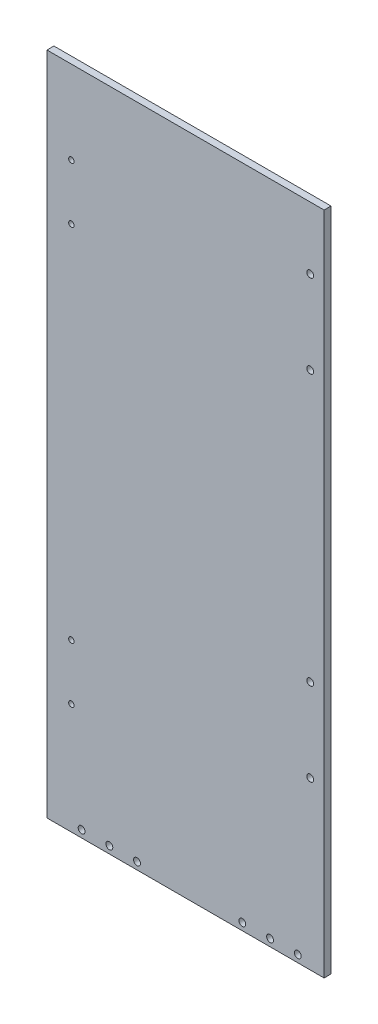
ISO-10303-21;
HEADER;
FILE_DESCRIPTION(('STEP AP214'),'2;1');
FILE_NAME('part.step','',(''),(''),'','','');
FILE_SCHEMA(('AUTOMOTIVE_DESIGN { 1 0 10303 214 1 1 1 1 }'));
ENDSEC;
DATA;
#1=APPLICATION_CONTEXT('core data for automotive mechanical design processes');
#2=APPLICATION_PROTOCOL_DEFINITION('international standard','automotive_design',2000,#1);
#3=PRODUCT_CONTEXT('',#1,'mechanical');
#4=PRODUCT('Part','Part','',(#3));
#5=PRODUCT_RELATED_PRODUCT_CATEGORY('part','',(#4));
#6=PRODUCT_DEFINITION_FORMATION('','',#4);
#7=PRODUCT_DEFINITION_CONTEXT('part definition',#1,'design');
#8=PRODUCT_DEFINITION('design','',#6,#7);
#9=PRODUCT_DEFINITION_SHAPE('','',#8);
#10=(LENGTH_UNIT() NAMED_UNIT(*) SI_UNIT(.MILLI.,.METRE.));
#11=(NAMED_UNIT(*) PLANE_ANGLE_UNIT() SI_UNIT($,.RADIAN.));
#12=(NAMED_UNIT(*) SI_UNIT($,.STERADIAN.) SOLID_ANGLE_UNIT());
#13=UNCERTAINTY_MEASURE_WITH_UNIT(LENGTH_MEASURE(1.E-05),#10,'distance_accuracy_value','');
#14=(GEOMETRIC_REPRESENTATION_CONTEXT(3) GLOBAL_UNCERTAINTY_ASSIGNED_CONTEXT((#13)) GLOBAL_UNIT_ASSIGNED_CONTEXT((#10,
#11,#12)) REPRESENTATION_CONTEXT('',''));
#15=CARTESIAN_POINT('',(0.,0.,0.));
#16=DIRECTION('',(0.,0.,1.));
#17=DIRECTION('',(1.,0.,0.));
#18=AXIS2_PLACEMENT_3D('',#15,#16,#17);
#19=CARTESIAN_POINT('',(0.,-234.461538461538,6.35));
#20=DIRECTION('',(0.,-1.,0.));
#21=DIRECTION('',(1.,0.,0.));
#22=AXIS2_PLACEMENT_3D('',#19,#20,#21);
#23=PLANE('',#22);
#24=DIRECTION('',(-1.,0.,0.));
#25=VECTOR('',#24,1.);
#26=CARTESIAN_POINT('',(0.,-234.461538461538,0.));
#27=LINE('',#26,#25);
#28=CARTESIAN_POINT('',(0.,-234.461538461538,0.));
#29=VERTEX_POINT('',#28);
#30=CARTESIAN_POINT('',(-254.,-234.461538461538,0.));
#31=VERTEX_POINT('',#30);
#32=EDGE_CURVE('E109',#29,#31,#27,.T.);
#33=ORIENTED_EDGE('',*,*,#32,.T.);
#34=DIRECTION('',(0.,0.,-1.));
#35=VECTOR('',#34,1.);
#36=CARTESIAN_POINT('',(-254.,-234.461538461538,6.35));
#37=LINE('',#36,#35);
#38=CARTESIAN_POINT('',(-254.,-234.461538461538,6.35));
#39=VERTEX_POINT('',#38);
#40=EDGE_CURVE('E11',#39,#31,#37,.T.);
#41=ORIENTED_EDGE('',*,*,#40,.F.);
#42=DIRECTION('',(-1.,0.,0.));
#43=VECTOR('',#42,1.);
#44=CARTESIAN_POINT('',(0.,-234.461538461538,6.35));
#45=LINE('',#44,#43);
#46=CARTESIAN_POINT('',(0.,-234.461538461538,6.35));
#47=VERTEX_POINT('',#46);
#48=EDGE_CURVE('E91',#47,#39,#45,.T.);
#49=ORIENTED_EDGE('',*,*,#48,.F.);
#50=DIRECTION('',(0.,0.,-1.));
#51=VECTOR('',#50,1.);
#52=CARTESIAN_POINT('',(0.,-234.461538461538,6.35));
#53=LINE('',#52,#51);
#54=EDGE_CURVE('E58',#47,#29,#53,.T.);
#55=ORIENTED_EDGE('',*,*,#54,.T.);
#56=EDGE_LOOP('',(#33,#41,#49,#55));
#57=FACE_BOUND('',#56,.T.);
#58=ADVANCED_FACE('F41',(#57),#23,.F.);
#59=CARTESIAN_POINT('',(-254.,-234.461538461538,6.35));
#60=DIRECTION('',(1.,0.,0.));
#61=DIRECTION('',(0.,1.,0.));
#62=AXIS2_PLACEMENT_3D('',#59,#60,#61);
#63=PLANE('',#62);
#64=DIRECTION('',(0.,-1.,0.));
#65=VECTOR('',#64,1.);
#66=CARTESIAN_POINT('',(-254.,-234.461538461538,0.));
#67=LINE('',#66,#65);
#68=CARTESIAN_POINT('',(-254.,-844.061538461538,0.));
#69=VERTEX_POINT('',#68);
#70=EDGE_CURVE('E97',#31,#69,#67,.T.);
#71=ORIENTED_EDGE('',*,*,#70,.T.);
#72=DIRECTION('',(0.,0.,-1.));
#73=VECTOR('',#72,1.);
#74=CARTESIAN_POINT('',(-254.,-844.061538461538,6.35));
#75=LINE('',#74,#73);
#76=CARTESIAN_POINT('',(-254.,-844.061538461538,6.35));
#77=VERTEX_POINT('',#76);
#78=EDGE_CURVE('E50',#77,#69,#75,.T.);
#79=ORIENTED_EDGE('',*,*,#78,.F.);
#80=DIRECTION('',(0.,-1.,0.));
#81=VECTOR('',#80,1.);
#82=CARTESIAN_POINT('',(-254.,-234.461538461538,6.35));
#83=LINE('',#82,#81);
#84=EDGE_CURVE('E83',#39,#77,#83,.T.);
#85=ORIENTED_EDGE('',*,*,#84,.F.);
#86=ORIENTED_EDGE('',*,*,#40,.T.);
#87=EDGE_LOOP('',(#71,#79,#85,#86));
#88=FACE_BOUND('',#87,.T.);
#89=ADVANCED_FACE('F96',(#88),#63,.F.);
#90=CARTESIAN_POINT('',(0.,-844.061538461538,6.35));
#91=DIRECTION('',(0.,-1.,0.));
#92=DIRECTION('',(0.,0.,-1.));
#93=AXIS2_PLACEMENT_3D('',#90,#91,#92);
#94=PLANE('',#93);
#95=DIRECTION('',(-1.,0.,0.));
#96=VECTOR('',#95,1.);
#97=CARTESIAN_POINT('',(0.,-844.061538461538,0.));
#98=LINE('',#97,#96);
#99=CARTESIAN_POINT('',(0.,-844.061538461538,0.));
#100=VERTEX_POINT('',#99);
#101=EDGE_CURVE('E115',#100,#69,#98,.T.);
#102=ORIENTED_EDGE('',*,*,#101,.F.);
#103=DIRECTION('',(0.,0.,-1.));
#104=VECTOR('',#103,1.);
#105=CARTESIAN_POINT('',(0.,-844.061538461538,6.35));
#106=LINE('',#105,#104);
#107=CARTESIAN_POINT('',(0.,-844.061538461538,6.35));
#108=VERTEX_POINT('',#107);
#109=EDGE_CURVE('E72',#108,#100,#106,.T.);
#110=ORIENTED_EDGE('',*,*,#109,.F.);
#111=DIRECTION('',(-1.,0.,0.));
#112=VECTOR('',#111,1.);
#113=CARTESIAN_POINT('',(0.,-844.061538461538,6.35));
#114=LINE('',#113,#112);
#115=EDGE_CURVE('E90',#108,#77,#114,.T.);
#116=ORIENTED_EDGE('',*,*,#115,.T.);
#117=ORIENTED_EDGE('',*,*,#78,.T.);
#118=EDGE_LOOP('',(#102,#110,#116,#117));
#119=FACE_BOUND('',#118,.T.);
#120=ADVANCED_FACE('F101',(#119),#94,.T.);
#121=CARTESIAN_POINT('',(0.,-234.461538461538,6.35));
#122=DIRECTION('',(1.,0.,0.));
#123=DIRECTION('',(0.,1.,0.));
#124=AXIS2_PLACEMENT_3D('',#121,#122,#123);
#125=PLANE('',#124);
#126=DIRECTION('',(0.,-1.,0.));
#127=VECTOR('',#126,1.);
#128=CARTESIAN_POINT('',(0.,-234.461538461538,0.));
#129=LINE('',#128,#127);
#130=EDGE_CURVE('E118',#29,#100,#129,.T.);
#131=ORIENTED_EDGE('',*,*,#130,.F.);
#132=ORIENTED_EDGE('',*,*,#54,.F.);
#133=DIRECTION('',(0.,-1.,0.));
#134=VECTOR('',#133,1.);
#135=CARTESIAN_POINT('',(0.,-234.461538461538,6.35));
#136=LINE('',#135,#134);
#137=EDGE_CURVE('E103',#47,#108,#136,.T.);
#138=ORIENTED_EDGE('',*,*,#137,.T.);
#139=ORIENTED_EDGE('',*,*,#109,.T.);
#140=EDGE_LOOP('',(#131,#132,#138,#139));
#141=FACE_BOUND('',#140,.T.);
#142=ADVANCED_FACE('F252',(#141),#125,.T.);
#143=CARTESIAN_POINT('',(0.,0.,6.35));
#144=DIRECTION('',(0.,0.,1.));
#145=DIRECTION('',(1.,0.,0.));
#146=AXIS2_PLACEMENT_3D('',#143,#144,#145);
#147=PLANE('',#146);
#148=CARTESIAN_POINT('',(-12.7,-291.611538461538,6.35));
#149=DIRECTION('',(0.,0.,1.));
#150=DIRECTION('',(1.,0.,0.));
#151=AXIS2_PLACEMENT_3D('',#148,#149,#150);
#152=CIRCLE('',#151,3.175);
#153=CARTESIAN_POINT('',(-9.52499999999997,-291.611538461538,6.35));
#154=VERTEX_POINT('',#153);
#155=EDGE_CURVE('E225',#154,#154,#152,.T.);
#156=ORIENTED_EDGE('',*,*,#155,.F.);
#157=EDGE_LOOP('',(#156));
#158=FACE_BOUND('',#157,.T.);
#159=CARTESIAN_POINT('',(-12.7,-615.461538461538,6.35));
#160=DIRECTION('',(0.,0.,1.));
#161=DIRECTION('',(1.,0.,0.));
#162=AXIS2_PLACEMENT_3D('',#159,#160,#161);
#163=CIRCLE('',#162,3.175);
#164=CARTESIAN_POINT('',(-9.52499999999996,-615.461538461538,6.35));
#165=VERTEX_POINT('',#164);
#166=EDGE_CURVE('E226',#165,#165,#163,.T.);
#167=ORIENTED_EDGE('',*,*,#166,.F.);
#168=EDGE_LOOP('',(#167));
#169=FACE_BOUND('',#168,.T.);
#170=CARTESIAN_POINT('',(-12.7,-691.661538461538,6.35));
#171=DIRECTION('',(0.,0.,1.));
#172=DIRECTION('',(1.,0.,0.));
#173=AXIS2_PLACEMENT_3D('',#170,#171,#172);
#174=CIRCLE('',#173,3.175);
#175=CARTESIAN_POINT('',(-9.52499999999997,-691.661538461538,6.35));
#176=VERTEX_POINT('',#175);
#177=EDGE_CURVE('E208',#176,#176,#174,.T.);
#178=ORIENTED_EDGE('',*,*,#177,.F.);
#179=EDGE_LOOP('',(#178));
#180=FACE_BOUND('',#179,.T.);
#181=CARTESIAN_POINT('',(-12.7,-367.811538461538,6.35));
#182=DIRECTION('',(0.,0.,1.));
#183=DIRECTION('',(1.,0.,0.));
#184=AXIS2_PLACEMENT_3D('',#181,#182,#183);
#185=CIRCLE('',#184,3.175);
#186=CARTESIAN_POINT('',(-9.52499999999997,-367.811538461538,6.35));
#187=VERTEX_POINT('',#186);
#188=EDGE_CURVE('E217',#187,#187,#185,.T.);
#189=ORIENTED_EDGE('',*,*,#188,.F.);
#190=EDGE_LOOP('',(#189));
#191=FACE_BOUND('',#190,.T.);
#192=CARTESIAN_POINT('',(-24.13,-837.457538461538,6.35));
#193=DIRECTION('',(0.,0.,-1.));
#194=DIRECTION('',(-1.,0.,0.));
#195=AXIS2_PLACEMENT_3D('',#192,#193,#194);
#196=CIRCLE('',#195,3.175);
#197=CARTESIAN_POINT('',(-27.305,-837.457538461538,6.35));
#198=VERTEX_POINT('',#197);
#199=EDGE_CURVE('E133',#198,#198,#196,.T.);
#200=ORIENTED_EDGE('',*,*,#199,.T.);
#201=EDGE_LOOP('',(#200));
#202=FACE_BOUND('',#201,.T.);
#203=CARTESIAN_POINT('',(-49.53,-837.457538461538,6.35));
#204=DIRECTION('',(0.,0.,-1.));
#205=DIRECTION('',(-1.,0.,0.));
#206=AXIS2_PLACEMENT_3D('',#203,#204,#205);
#207=CIRCLE('',#206,3.175);
#208=CARTESIAN_POINT('',(-52.705,-837.457538461538,6.35));
#209=VERTEX_POINT('',#208);
#210=EDGE_CURVE('E197',#209,#209,#207,.T.);
#211=ORIENTED_EDGE('',*,*,#210,.T.);
#212=EDGE_LOOP('',(#211));
#213=FACE_BOUND('',#212,.T.);
#214=CARTESIAN_POINT('',(-74.9915552075629,-837.457538461538,6.35));
#215=DIRECTION('',(0.,0.,-1.));
#216=DIRECTION('',(-1.,0.,0.));
#217=AXIS2_PLACEMENT_3D('',#214,#215,#216);
#218=CIRCLE('',#217,3.175);
#219=CARTESIAN_POINT('',(-78.1665552075629,-837.457538461538,6.35));
#220=VERTEX_POINT('',#219);
#221=EDGE_CURVE('E189',#220,#220,#218,.T.);
#222=ORIENTED_EDGE('',*,*,#221,.T.);
#223=EDGE_LOOP('',(#222));
#224=FACE_BOUND('',#223,.T.);
#225=CARTESIAN_POINT('',(-196.85,-837.457538461538,6.35));
#226=DIRECTION('',(0.,0.,-1.));
#227=DIRECTION('',(-1.,0.,0.));
#228=AXIS2_PLACEMENT_3D('',#225,#226,#227);
#229=CIRCLE('',#228,3.175);
#230=CARTESIAN_POINT('',(-200.025,-837.457538461538,6.35));
#231=VERTEX_POINT('',#230);
#232=EDGE_CURVE('E181',#231,#231,#229,.T.);
#233=ORIENTED_EDGE('',*,*,#232,.T.);
#234=EDGE_LOOP('',(#233));
#235=FACE_BOUND('',#234,.T.);
#236=CARTESIAN_POINT('',(-171.45,-837.457538461538,6.35));
#237=DIRECTION('',(0.,0.,-1.));
#238=DIRECTION('',(-1.,0.,0.));
#239=AXIS2_PLACEMENT_3D('',#236,#237,#238);
#240=CIRCLE('',#239,3.17499999999997);
#241=CARTESIAN_POINT('',(-174.625,-837.457538461538,6.35));
#242=VERTEX_POINT('',#241);
#243=EDGE_CURVE('E173',#242,#242,#240,.T.);
#244=ORIENTED_EDGE('',*,*,#243,.T.);
#245=EDGE_LOOP('',(#244));
#246=FACE_BOUND('',#245,.T.);
#247=CARTESIAN_POINT('',(-222.25,-837.457538461538,6.35));
#248=DIRECTION('',(0.,0.,-1.));
#249=DIRECTION('',(-1.,0.,0.));
#250=AXIS2_PLACEMENT_3D('',#247,#248,#249);
#251=CIRCLE('',#250,3.17499999999997);
#252=CARTESIAN_POINT('',(-225.425,-837.457538461538,6.35));
#253=VERTEX_POINT('',#252);
#254=EDGE_CURVE('E164',#253,#253,#251,.T.);
#255=ORIENTED_EDGE('',*,*,#254,.T.);
#256=EDGE_LOOP('',(#255));
#257=FACE_BOUND('',#256,.T.);
#258=CARTESIAN_POINT('',(-231.648,-310.661538461538,6.35));
#259=DIRECTION('',(0.,0.,1.));
#260=DIRECTION('',(1.,0.,0.));
#261=AXIS2_PLACEMENT_3D('',#258,#259,#260);
#262=CIRCLE('',#261,2.4638);
#263=CARTESIAN_POINT('',(-229.1842,-310.661538461538,6.35));
#264=VERTEX_POINT('',#263);
#265=EDGE_CURVE('E153',#264,#264,#262,.T.);
#266=ORIENTED_EDGE('',*,*,#265,.F.);
#267=EDGE_LOOP('',(#266));
#268=FACE_BOUND('',#267,.T.);
#269=CARTESIAN_POINT('',(-231.648,-361.461538461538,6.35));
#270=DIRECTION('',(0.,0.,1.));
#271=DIRECTION('',(1.,0.,0.));
#272=AXIS2_PLACEMENT_3D('',#269,#270,#271);
#273=CIRCLE('',#272,2.4638);
#274=CARTESIAN_POINT('',(-229.1842,-361.461538461538,6.35));
#275=VERTEX_POINT('',#274);
#276=EDGE_CURVE('E145',#275,#275,#273,.T.);
#277=ORIENTED_EDGE('',*,*,#276,.F.);
#278=EDGE_LOOP('',(#277));
#279=FACE_BOUND('',#278,.T.);
#280=CARTESIAN_POINT('',(-231.648,-691.661538461538,6.35));
#281=DIRECTION('',(0.,0.,1.));
#282=DIRECTION('',(1.,0.,0.));
#283=AXIS2_PLACEMENT_3D('',#280,#281,#282);
#284=CIRCLE('',#283,2.4638);
#285=CARTESIAN_POINT('',(-229.1842,-691.661538461538,6.35));
#286=VERTEX_POINT('',#285);
#287=EDGE_CURVE('E137',#286,#286,#284,.T.);
#288=ORIENTED_EDGE('',*,*,#287,.F.);
#289=EDGE_LOOP('',(#288));
#290=FACE_BOUND('',#289,.T.);
#291=CARTESIAN_POINT('',(-231.648,-742.461538461538,6.35));
#292=DIRECTION('',(0.,0.,1.));
#293=DIRECTION('',(1.,0.,0.));
#294=AXIS2_PLACEMENT_3D('',#291,#292,#293);
#295=CIRCLE('',#294,2.4638);
#296=CARTESIAN_POINT('',(-229.1842,-742.461538461538,6.35));
#297=VERTEX_POINT('',#296);
#298=EDGE_CURVE('E128',#297,#297,#295,.T.);
#299=ORIENTED_EDGE('',*,*,#298,.F.);
#300=EDGE_LOOP('',(#299));
#301=FACE_BOUND('',#300,.T.);
#302=ORIENTED_EDGE('',*,*,#48,.T.);
#303=ORIENTED_EDGE('',*,*,#84,.T.);
#304=ORIENTED_EDGE('',*,*,#115,.F.);
#305=ORIENTED_EDGE('',*,*,#137,.F.);
#306=EDGE_LOOP('',(#302,#303,#304,#305));
#307=FACE_BOUND('',#306,.T.);
#308=ADVANCED_FACE('F87',(#158,#169,#180,#191,#202,#213,#224,#235,#246,#257,#268,#279,#290,#301,
#307),#147,.T.);
#309=CARTESIAN_POINT('',(0.,0.,0.));
#310=DIRECTION('',(0.,0.,1.));
#311=DIRECTION('',(1.,0.,0.));
#312=AXIS2_PLACEMENT_3D('',#309,#310,#311);
#313=PLANE('',#312);
#314=CARTESIAN_POINT('',(-12.7,-291.611538461538,0.));
#315=DIRECTION('',(0.,0.,1.));
#316=DIRECTION('',(1.,0.,0.));
#317=AXIS2_PLACEMENT_3D('',#314,#315,#316);
#318=CIRCLE('',#317,3.175);
#319=CARTESIAN_POINT('',(-9.52499999999997,-291.611538461538,0.));
#320=VERTEX_POINT('',#319);
#321=EDGE_CURVE('E165',#320,#320,#318,.T.);
#322=ORIENTED_EDGE('',*,*,#321,.T.);
#323=EDGE_LOOP('',(#322));
#324=FACE_BOUND('',#323,.T.);
#325=CARTESIAN_POINT('',(-12.7,-615.461538461538,0.));
#326=DIRECTION('',(0.,0.,1.));
#327=DIRECTION('',(1.,0.,0.));
#328=AXIS2_PLACEMENT_3D('',#325,#326,#327);
#329=CIRCLE('',#328,3.175);
#330=CARTESIAN_POINT('',(-9.52499999999996,-615.461538461538,0.));
#331=VERTEX_POINT('',#330);
#332=EDGE_CURVE('E213',#331,#331,#329,.T.);
#333=ORIENTED_EDGE('',*,*,#332,.T.);
#334=EDGE_LOOP('',(#333));
#335=FACE_BOUND('',#334,.T.);
#336=CARTESIAN_POINT('',(-12.7,-691.661538461538,0.));
#337=DIRECTION('',(0.,0.,1.));
#338=DIRECTION('',(1.,0.,0.));
#339=AXIS2_PLACEMENT_3D('',#336,#337,#338);
#340=CIRCLE('',#339,3.175);
#341=CARTESIAN_POINT('',(-9.52499999999997,-691.661538461538,0.));
#342=VERTEX_POINT('',#341);
#343=EDGE_CURVE('E212',#342,#342,#340,.T.);
#344=ORIENTED_EDGE('',*,*,#343,.T.);
#345=EDGE_LOOP('',(#344));
#346=FACE_BOUND('',#345,.T.);
#347=CARTESIAN_POINT('',(-12.7,-367.811538461538,0.));
#348=DIRECTION('',(0.,0.,1.));
#349=DIRECTION('',(1.,0.,0.));
#350=AXIS2_PLACEMENT_3D('',#347,#348,#349);
#351=CIRCLE('',#350,3.175);
#352=CARTESIAN_POINT('',(-9.52499999999997,-367.811538461538,0.));
#353=VERTEX_POINT('',#352);
#354=EDGE_CURVE('E221',#353,#353,#351,.T.);
#355=ORIENTED_EDGE('',*,*,#354,.T.);
#356=EDGE_LOOP('',(#355));
#357=FACE_BOUND('',#356,.T.);
#358=CARTESIAN_POINT('',(-24.13,-837.457538461538,0.));
#359=DIRECTION('',(0.,0.,-1.));
#360=DIRECTION('',(-1.,0.,0.));
#361=AXIS2_PLACEMENT_3D('',#358,#359,#360);
#362=CIRCLE('',#361,3.175);
#363=CARTESIAN_POINT('',(-27.305,-837.457538461538,0.));
#364=VERTEX_POINT('',#363);
#365=EDGE_CURVE('E201',#364,#364,#362,.T.);
#366=ORIENTED_EDGE('',*,*,#365,.F.);
#367=EDGE_LOOP('',(#366));
#368=FACE_BOUND('',#367,.T.);
#369=CARTESIAN_POINT('',(-49.53,-837.457538461538,0.));
#370=DIRECTION('',(0.,0.,-1.));
#371=DIRECTION('',(-1.,0.,0.));
#372=AXIS2_PLACEMENT_3D('',#369,#370,#371);
#373=CIRCLE('',#372,3.175);
#374=CARTESIAN_POINT('',(-52.705,-837.457538461538,0.));
#375=VERTEX_POINT('',#374);
#376=EDGE_CURVE('E193',#375,#375,#373,.T.);
#377=ORIENTED_EDGE('',*,*,#376,.F.);
#378=EDGE_LOOP('',(#377));
#379=FACE_BOUND('',#378,.T.);
#380=CARTESIAN_POINT('',(-74.9915552075629,-837.457538461538,0.));
#381=DIRECTION('',(0.,0.,-1.));
#382=DIRECTION('',(-1.,0.,0.));
#383=AXIS2_PLACEMENT_3D('',#380,#381,#382);
#384=CIRCLE('',#383,3.175);
#385=CARTESIAN_POINT('',(-78.1665552075629,-837.457538461538,0.));
#386=VERTEX_POINT('',#385);
#387=EDGE_CURVE('E185',#386,#386,#384,.T.);
#388=ORIENTED_EDGE('',*,*,#387,.F.);
#389=EDGE_LOOP('',(#388));
#390=FACE_BOUND('',#389,.T.);
#391=CARTESIAN_POINT('',(-196.85,-837.457538461538,0.));
#392=DIRECTION('',(0.,0.,-1.));
#393=DIRECTION('',(-1.,0.,0.));
#394=AXIS2_PLACEMENT_3D('',#391,#392,#393);
#395=CIRCLE('',#394,3.175);
#396=CARTESIAN_POINT('',(-200.025,-837.457538461538,0.));
#397=VERTEX_POINT('',#396);
#398=EDGE_CURVE('E177',#397,#397,#395,.T.);
#399=ORIENTED_EDGE('',*,*,#398,.F.);
#400=EDGE_LOOP('',(#399));
#401=FACE_BOUND('',#400,.T.);
#402=CARTESIAN_POINT('',(-171.45,-837.457538461538,0.));
#403=DIRECTION('',(0.,0.,-1.));
#404=DIRECTION('',(-1.,0.,0.));
#405=AXIS2_PLACEMENT_3D('',#402,#403,#404);
#406=CIRCLE('',#405,3.17499999999997);
#407=CARTESIAN_POINT('',(-174.625,-837.457538461538,0.));
#408=VERTEX_POINT('',#407);
#409=EDGE_CURVE('E169',#408,#408,#406,.T.);
#410=ORIENTED_EDGE('',*,*,#409,.F.);
#411=EDGE_LOOP('',(#410));
#412=FACE_BOUND('',#411,.T.);
#413=CARTESIAN_POINT('',(-222.25,-837.457538461538,0.));
#414=DIRECTION('',(0.,0.,-1.));
#415=DIRECTION('',(-1.,0.,0.));
#416=AXIS2_PLACEMENT_3D('',#413,#414,#415);
#417=CIRCLE('',#416,3.17499999999997);
#418=CARTESIAN_POINT('',(-225.425,-837.457538461538,0.));
#419=VERTEX_POINT('',#418);
#420=EDGE_CURVE('E160',#419,#419,#417,.T.);
#421=ORIENTED_EDGE('',*,*,#420,.F.);
#422=EDGE_LOOP('',(#421));
#423=FACE_BOUND('',#422,.T.);
#424=CARTESIAN_POINT('',(-231.648,-310.661538461538,0.));
#425=DIRECTION('',(0.,0.,1.));
#426=DIRECTION('',(1.,0.,0.));
#427=AXIS2_PLACEMENT_3D('',#424,#425,#426);
#428=CIRCLE('',#427,2.4638);
#429=CARTESIAN_POINT('',(-229.1842,-310.661538461538,0.));
#430=VERTEX_POINT('',#429);
#431=EDGE_CURVE('E112',#430,#430,#428,.T.);
#432=ORIENTED_EDGE('',*,*,#431,.T.);
#433=EDGE_LOOP('',(#432));
#434=FACE_BOUND('',#433,.T.);
#435=CARTESIAN_POINT('',(-231.648,-361.461538461538,0.));
#436=DIRECTION('',(0.,0.,1.));
#437=DIRECTION('',(1.,0.,0.));
#438=AXIS2_PLACEMENT_3D('',#435,#436,#437);
#439=CIRCLE('',#438,2.4638);
#440=CARTESIAN_POINT('',(-229.1842,-361.461538461538,0.));
#441=VERTEX_POINT('',#440);
#442=EDGE_CURVE('E149',#441,#441,#439,.T.);
#443=ORIENTED_EDGE('',*,*,#442,.T.);
#444=EDGE_LOOP('',(#443));
#445=FACE_BOUND('',#444,.T.);
#446=CARTESIAN_POINT('',(-231.648,-691.661538461538,0.));
#447=DIRECTION('',(0.,0.,1.));
#448=DIRECTION('',(1.,0.,0.));
#449=AXIS2_PLACEMENT_3D('',#446,#447,#448);
#450=CIRCLE('',#449,2.4638);
#451=CARTESIAN_POINT('',(-229.1842,-691.661538461538,0.));
#452=VERTEX_POINT('',#451);
#453=EDGE_CURVE('E141',#452,#452,#450,.T.);
#454=ORIENTED_EDGE('',*,*,#453,.T.);
#455=EDGE_LOOP('',(#454));
#456=FACE_BOUND('',#455,.T.);
#457=CARTESIAN_POINT('',(-231.648,-742.461538461538,0.));
#458=DIRECTION('',(0.,0.,1.));
#459=DIRECTION('',(1.,0.,0.));
#460=AXIS2_PLACEMENT_3D('',#457,#458,#459);
#461=CIRCLE('',#460,2.4638);
#462=CARTESIAN_POINT('',(-229.1842,-742.461538461538,0.));
#463=VERTEX_POINT('',#462);
#464=EDGE_CURVE('E132',#463,#463,#461,.T.);
#465=ORIENTED_EDGE('',*,*,#464,.T.);
#466=EDGE_LOOP('',(#465));
#467=FACE_BOUND('',#466,.T.);
#468=ORIENTED_EDGE('',*,*,#32,.F.);
#469=ORIENTED_EDGE('',*,*,#130,.T.);
#470=ORIENTED_EDGE('',*,*,#101,.T.);
#471=ORIENTED_EDGE('',*,*,#70,.F.);
#472=EDGE_LOOP('',(#468,#469,#470,#471));
#473=FACE_BOUND('',#472,.T.);
#474=ADVANCED_FACE('F240',(#324,#335,#346,#357,#368,#379,#390,#401,#412,#423,#434,#445,#456,
#467,#473),#313,.F.);
#475=CARTESIAN_POINT('',(-231.648,-742.461538461538,0.));
#476=DIRECTION('',(0.,0.,1.));
#477=DIRECTION('',(1.,0.,0.));
#478=AXIS2_PLACEMENT_3D('',#475,#476,#477);
#479=CYLINDRICAL_SURFACE('',#478,2.4638);
#480=ORIENTED_EDGE('',*,*,#464,.F.);
#481=EDGE_LOOP('',(#480));
#482=FACE_BOUND('',#481,.T.);
#483=ORIENTED_EDGE('',*,*,#298,.T.);
#484=EDGE_LOOP('',(#483));
#485=FACE_BOUND('',#484,.T.);
#486=ADVANCED_FACE('F280',(#482,#485),#479,.F.);
#487=CARTESIAN_POINT('',(-231.648,-691.661538461538,0.));
#488=DIRECTION('',(0.,0.,1.));
#489=DIRECTION('',(1.,0.,0.));
#490=AXIS2_PLACEMENT_3D('',#487,#488,#489);
#491=CYLINDRICAL_SURFACE('',#490,2.4638);
#492=ORIENTED_EDGE('',*,*,#453,.F.);
#493=EDGE_LOOP('',(#492));
#494=FACE_BOUND('',#493,.T.);
#495=ORIENTED_EDGE('',*,*,#287,.T.);
#496=EDGE_LOOP('',(#495));
#497=FACE_BOUND('',#496,.T.);
#498=ADVANCED_FACE('F282',(#494,#497),#491,.F.);
#499=CARTESIAN_POINT('',(-231.648,-361.461538461538,0.));
#500=DIRECTION('',(0.,0.,1.));
#501=DIRECTION('',(1.,0.,0.));
#502=AXIS2_PLACEMENT_3D('',#499,#500,#501);
#503=CYLINDRICAL_SURFACE('',#502,2.4638);
#504=ORIENTED_EDGE('',*,*,#442,.F.);
#505=EDGE_LOOP('',(#504));
#506=FACE_BOUND('',#505,.T.);
#507=ORIENTED_EDGE('',*,*,#276,.T.);
#508=EDGE_LOOP('',(#507));
#509=FACE_BOUND('',#508,.T.);
#510=ADVANCED_FACE('F289',(#506,#509),#503,.F.);
#511=CARTESIAN_POINT('',(-231.648,-310.661538461538,0.));
#512=DIRECTION('',(0.,0.,1.));
#513=DIRECTION('',(1.,0.,0.));
#514=AXIS2_PLACEMENT_3D('',#511,#512,#513);
#515=CYLINDRICAL_SURFACE('',#514,2.4638);
#516=ORIENTED_EDGE('',*,*,#431,.F.);
#517=EDGE_LOOP('',(#516));
#518=FACE_BOUND('',#517,.T.);
#519=ORIENTED_EDGE('',*,*,#265,.T.);
#520=EDGE_LOOP('',(#519));
#521=FACE_BOUND('',#520,.T.);
#522=ADVANCED_FACE('F351',(#518,#521),#515,.F.);
#523=CARTESIAN_POINT('',(-222.25,-837.457538461538,6.35));
#524=DIRECTION('',(0.,0.,-1.));
#525=DIRECTION('',(-1.,0.,0.));
#526=AXIS2_PLACEMENT_3D('',#523,#524,#525);
#527=CYLINDRICAL_SURFACE('',#526,3.17499999999997);
#528=ORIENTED_EDGE('',*,*,#254,.F.);
#529=EDGE_LOOP('',(#528));
#530=FACE_BOUND('',#529,.T.);
#531=ORIENTED_EDGE('',*,*,#420,.T.);
#532=EDGE_LOOP('',(#531));
#533=FACE_BOUND('',#532,.T.);
#534=ADVANCED_FACE('F360',(#530,#533),#527,.F.);
#535=CARTESIAN_POINT('',(-171.45,-837.457538461538,6.35));
#536=DIRECTION('',(0.,0.,-1.));
#537=DIRECTION('',(-1.,0.,0.));
#538=AXIS2_PLACEMENT_3D('',#535,#536,#537);
#539=CYLINDRICAL_SURFACE('',#538,3.17499999999997);
#540=ORIENTED_EDGE('',*,*,#243,.F.);
#541=EDGE_LOOP('',(#540));
#542=FACE_BOUND('',#541,.T.);
#543=ORIENTED_EDGE('',*,*,#409,.T.);
#544=EDGE_LOOP('',(#543));
#545=FACE_BOUND('',#544,.T.);
#546=ADVANCED_FACE('F369',(#542,#545),#539,.F.);
#547=CARTESIAN_POINT('',(-196.85,-837.457538461538,6.35));
#548=DIRECTION('',(0.,0.,-1.));
#549=DIRECTION('',(-1.,0.,0.));
#550=AXIS2_PLACEMENT_3D('',#547,#548,#549);
#551=CYLINDRICAL_SURFACE('',#550,3.175);
#552=ORIENTED_EDGE('',*,*,#232,.F.);
#553=EDGE_LOOP('',(#552));
#554=FACE_BOUND('',#553,.T.);
#555=ORIENTED_EDGE('',*,*,#398,.T.);
#556=EDGE_LOOP('',(#555));
#557=FACE_BOUND('',#556,.T.);
#558=ADVANCED_FACE('F378',(#554,#557),#551,.F.);
#559=CARTESIAN_POINT('',(-74.9915552075629,-837.457538461538,6.35));
#560=DIRECTION('',(0.,0.,-1.));
#561=DIRECTION('',(-1.,0.,0.));
#562=AXIS2_PLACEMENT_3D('',#559,#560,#561);
#563=CYLINDRICAL_SURFACE('',#562,3.175);
#564=ORIENTED_EDGE('',*,*,#221,.F.);
#565=EDGE_LOOP('',(#564));
#566=FACE_BOUND('',#565,.T.);
#567=ORIENTED_EDGE('',*,*,#387,.T.);
#568=EDGE_LOOP('',(#567));
#569=FACE_BOUND('',#568,.T.);
#570=ADVANCED_FACE('F387',(#566,#569),#563,.F.);
#571=CARTESIAN_POINT('',(-49.53,-837.457538461538,6.35));
#572=DIRECTION('',(0.,0.,-1.));
#573=DIRECTION('',(-1.,0.,0.));
#574=AXIS2_PLACEMENT_3D('',#571,#572,#573);
#575=CYLINDRICAL_SURFACE('',#574,3.175);
#576=ORIENTED_EDGE('',*,*,#210,.F.);
#577=EDGE_LOOP('',(#576));
#578=FACE_BOUND('',#577,.T.);
#579=ORIENTED_EDGE('',*,*,#376,.T.);
#580=EDGE_LOOP('',(#579));
#581=FACE_BOUND('',#580,.T.);
#582=ADVANCED_FACE('F396',(#578,#581),#575,.F.);
#583=CARTESIAN_POINT('',(-24.13,-837.457538461538,6.35));
#584=DIRECTION('',(0.,0.,-1.));
#585=DIRECTION('',(-1.,0.,0.));
#586=AXIS2_PLACEMENT_3D('',#583,#584,#585);
#587=CYLINDRICAL_SURFACE('',#586,3.175);
#588=ORIENTED_EDGE('',*,*,#199,.F.);
#589=EDGE_LOOP('',(#588));
#590=FACE_BOUND('',#589,.T.);
#591=ORIENTED_EDGE('',*,*,#365,.T.);
#592=EDGE_LOOP('',(#591));
#593=FACE_BOUND('',#592,.T.);
#594=ADVANCED_FACE('F405',(#590,#593),#587,.F.);
#595=CARTESIAN_POINT('',(-12.7,-367.811538461538,0.));
#596=DIRECTION('',(0.,0.,1.));
#597=DIRECTION('',(1.,0.,0.));
#598=AXIS2_PLACEMENT_3D('',#595,#596,#597);
#599=CYLINDRICAL_SURFACE('',#598,3.175);
#600=ORIENTED_EDGE('',*,*,#354,.F.);
#601=EDGE_LOOP('',(#600));
#602=FACE_BOUND('',#601,.T.);
#603=ORIENTED_EDGE('',*,*,#188,.T.);
#604=EDGE_LOOP('',(#603));
#605=FACE_BOUND('',#604,.T.);
#606=ADVANCED_FACE('F413',(#602,#605),#599,.F.);
#607=CARTESIAN_POINT('',(-12.7,-691.661538461538,0.));
#608=DIRECTION('',(0.,0.,1.));
#609=DIRECTION('',(1.,0.,0.));
#610=AXIS2_PLACEMENT_3D('',#607,#608,#609);
#611=CYLINDRICAL_SURFACE('',#610,3.175);
#612=ORIENTED_EDGE('',*,*,#343,.F.);
#613=EDGE_LOOP('',(#612));
#614=FACE_BOUND('',#613,.T.);
#615=ORIENTED_EDGE('',*,*,#177,.T.);
#616=EDGE_LOOP('',(#615));
#617=FACE_BOUND('',#616,.T.);
#618=ADVANCED_FACE('F421',(#614,#617),#611,.F.);
#619=CARTESIAN_POINT('',(-12.7,-615.461538461538,0.));
#620=DIRECTION('',(0.,0.,1.));
#621=DIRECTION('',(1.,0.,0.));
#622=AXIS2_PLACEMENT_3D('',#619,#620,#621);
#623=CYLINDRICAL_SURFACE('',#622,3.175);
#624=ORIENTED_EDGE('',*,*,#332,.F.);
#625=EDGE_LOOP('',(#624));
#626=FACE_BOUND('',#625,.T.);
#627=ORIENTED_EDGE('',*,*,#166,.T.);
#628=EDGE_LOOP('',(#627));
#629=FACE_BOUND('',#628,.T.);
#630=ADVANCED_FACE('F246',(#626,#629),#623,.F.);
#631=CARTESIAN_POINT('',(-12.7,-291.611538461538,0.));
#632=DIRECTION('',(0.,0.,1.));
#633=DIRECTION('',(1.,0.,0.));
#634=AXIS2_PLACEMENT_3D('',#631,#632,#633);
#635=CYLINDRICAL_SURFACE('',#634,3.175);
#636=ORIENTED_EDGE('',*,*,#321,.F.);
#637=EDGE_LOOP('',(#636));
#638=FACE_BOUND('',#637,.T.);
#639=ORIENTED_EDGE('',*,*,#155,.T.);
#640=EDGE_LOOP('',(#639));
#641=FACE_BOUND('',#640,.T.);
#642=ADVANCED_FACE('F243',(#638,#641),#635,.F.);
#643=CLOSED_SHELL('',(#58,#89,#120,#142,#308,#474,#486,#498,#510,#522,#534,#546,#558,#570,#582,
#594,#606,#618,#630,#642));
#644=MANIFOLD_SOLID_BREP('B2',#643);
#645=ADVANCED_BREP_SHAPE_REPRESENTATION('',(#18,#644),#14);
#646=SHAPE_DEFINITION_REPRESENTATION(#9,#645);
ENDSEC;
END-ISO-10303-21;
